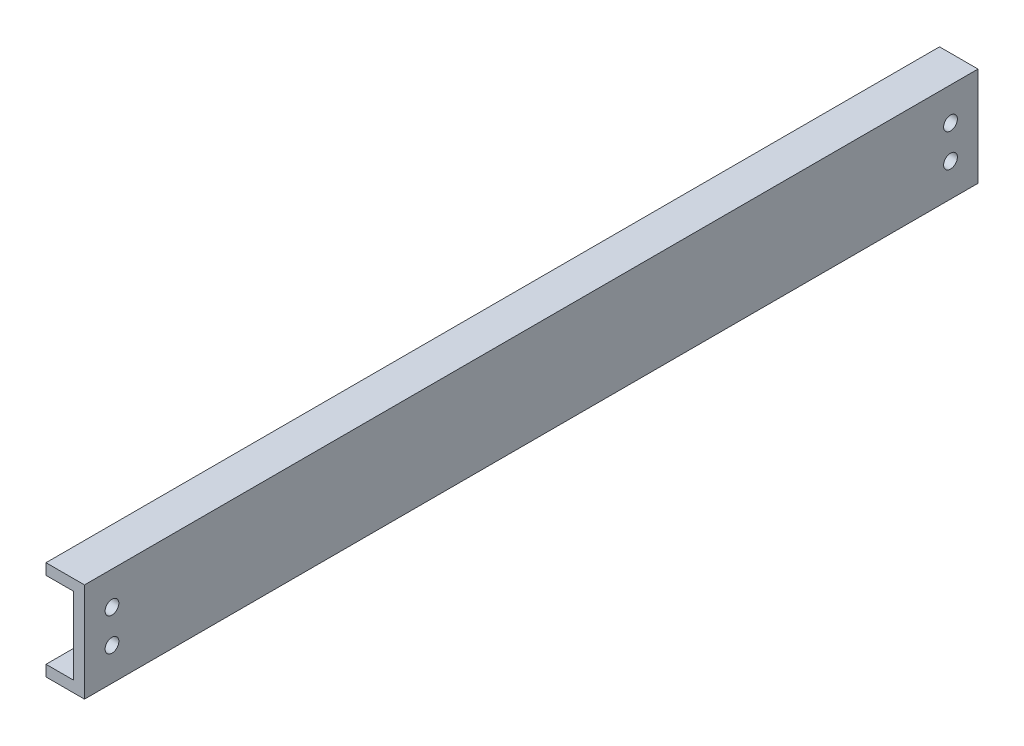
ISO-10303-21;
HEADER;
FILE_DESCRIPTION(('STEP AP214'),'2;1');
FILE_NAME('part.step','',(''),(''),'','','');
FILE_SCHEMA(('AUTOMOTIVE_DESIGN { 1 0 10303 214 1 1 1 1 }'));
ENDSEC;
DATA;
#1=APPLICATION_CONTEXT('core data for automotive mechanical design processes');
#2=APPLICATION_PROTOCOL_DEFINITION('international standard','automotive_design',2000,#1);
#3=PRODUCT_CONTEXT('',#1,'mechanical');
#4=PRODUCT('Part','Part','',(#3));
#5=PRODUCT_RELATED_PRODUCT_CATEGORY('part','',(#4));
#6=PRODUCT_DEFINITION_FORMATION('','',#4);
#7=PRODUCT_DEFINITION_CONTEXT('part definition',#1,'design');
#8=PRODUCT_DEFINITION('design','',#6,#7);
#9=PRODUCT_DEFINITION_SHAPE('','',#8);
#10=(LENGTH_UNIT() NAMED_UNIT(*) SI_UNIT(.MILLI.,.METRE.));
#11=(NAMED_UNIT(*) PLANE_ANGLE_UNIT() SI_UNIT($,.RADIAN.));
#12=(NAMED_UNIT(*) SI_UNIT($,.STERADIAN.) SOLID_ANGLE_UNIT());
#13=UNCERTAINTY_MEASURE_WITH_UNIT(LENGTH_MEASURE(1.E-05),#10,'distance_accuracy_value','');
#14=(GEOMETRIC_REPRESENTATION_CONTEXT(3) GLOBAL_UNCERTAINTY_ASSIGNED_CONTEXT((#13)) GLOBAL_UNIT_ASSIGNED_CONTEXT((#10,
#11,#12)) REPRESENTATION_CONTEXT('',''));
#15=CARTESIAN_POINT('',(0.,0.,0.));
#16=DIRECTION('',(0.,0.,1.));
#17=DIRECTION('',(1.,0.,0.));
#18=AXIS2_PLACEMENT_3D('',#15,#16,#17);
#19=CARTESIAN_POINT('',(-7.,9.88828278471343,-162.5));
#20=DIRECTION('',(-1.,0.,0.));
#21=DIRECTION('',(0.,0.,1.));
#22=AXIS2_PLACEMENT_3D('',#19,#20,#21);
#23=PLANE('',#22);
#24=DIRECTION('',(0.,-1.,0.));
#25=VECTOR('',#24,1.);
#26=CARTESIAN_POINT('',(-7.,9.88828278471343,0.));
#27=LINE('',#26,#25);
#28=CARTESIAN_POINT('',(-7.,9.88828278471343,0.));
#29=VERTEX_POINT('',#28);
#30=CARTESIAN_POINT('',(-7.,7.88828278471343,0.));
#31=VERTEX_POINT('',#30);
#32=EDGE_CURVE('E135',#29,#31,#27,.T.);
#33=ORIENTED_EDGE('',*,*,#32,.F.);
#34=DIRECTION('',(0.,0.,1.));
#35=VECTOR('',#34,1.);
#36=CARTESIAN_POINT('',(-7.,9.88828278471343,-162.5));
#37=LINE('',#36,#35);
#38=CARTESIAN_POINT('',(-7.,9.88828278471343,-162.5));
#39=VERTEX_POINT('',#38);
#40=EDGE_CURVE('E11',#39,#29,#37,.T.);
#41=ORIENTED_EDGE('',*,*,#40,.F.);
#42=DIRECTION('',(0.,-1.,0.));
#43=VECTOR('',#42,1.);
#44=CARTESIAN_POINT('',(-7.,9.88828278471343,-162.5));
#45=LINE('',#44,#43);
#46=CARTESIAN_POINT('',(-7.,7.88828278471343,-162.5));
#47=VERTEX_POINT('',#46);
#48=EDGE_CURVE('E155',#39,#47,#45,.T.);
#49=ORIENTED_EDGE('',*,*,#48,.T.);
#50=DIRECTION('',(0.,0.,1.));
#51=VECTOR('',#50,1.);
#52=CARTESIAN_POINT('',(-7.,7.88828278471343,-162.5));
#53=LINE('',#52,#51);
#54=EDGE_CURVE('E93',#47,#31,#53,.T.);
#55=ORIENTED_EDGE('',*,*,#54,.T.);
#56=EDGE_LOOP('',(#33,#41,#49,#55));
#57=FACE_BOUND('',#56,.T.);
#58=ADVANCED_FACE('F37',(#57),#23,.T.);
#59=CARTESIAN_POINT('',(-7.,9.88828278471343,-162.5));
#60=DIRECTION('',(0.,1.,0.));
#61=DIRECTION('',(-1.,0.,0.));
#62=AXIS2_PLACEMENT_3D('',#59,#60,#61);
#63=PLANE('',#62);
#64=DIRECTION('',(-1.,0.,0.));
#65=VECTOR('',#64,1.);
#66=CARTESIAN_POINT('',(-7.,9.88828278471343,0.));
#67=LINE('',#66,#65);
#68=CARTESIAN_POINT('',(0.,9.88828278471343,0.));
#69=VERTEX_POINT('',#68);
#70=EDGE_CURVE('E153',#69,#29,#67,.T.);
#71=ORIENTED_EDGE('',*,*,#70,.F.);
#72=DIRECTION('',(0.,0.,1.));
#73=VECTOR('',#72,1.);
#74=CARTESIAN_POINT('',(0.,9.88828278471343,-162.5));
#75=LINE('',#74,#73);
#76=CARTESIAN_POINT('',(0.,9.88828278471343,-162.5));
#77=VERTEX_POINT('',#76);
#78=EDGE_CURVE('E46',#77,#69,#75,.T.);
#79=ORIENTED_EDGE('',*,*,#78,.F.);
#80=DIRECTION('',(-1.,0.,0.));
#81=VECTOR('',#80,1.);
#82=CARTESIAN_POINT('',(-7.,9.88828278471343,-162.5));
#83=LINE('',#82,#81);
#84=EDGE_CURVE('E125',#77,#39,#83,.T.);
#85=ORIENTED_EDGE('',*,*,#84,.T.);
#86=ORIENTED_EDGE('',*,*,#40,.T.);
#87=EDGE_LOOP('',(#71,#79,#85,#86));
#88=FACE_BOUND('',#87,.T.);
#89=ADVANCED_FACE('F211',(#88),#63,.T.);
#90=CARTESIAN_POINT('',(0.,9.88828278471343,-162.5));
#91=DIRECTION('',(1.,0.,0.));
#92=DIRECTION('',(0.,1.,0.));
#93=AXIS2_PLACEMENT_3D('',#90,#91,#92);
#94=PLANE('',#93);
#95=CARTESIAN_POINT('',(0.,3.88828278471345,-157.5));
#96=DIRECTION('',(1.,0.,0.));
#97=DIRECTION('',(0.,-1.,0.));
#98=AXIS2_PLACEMENT_3D('',#95,#96,#97);
#99=CIRCLE('',#98,1.25000000000004);
#100=CARTESIAN_POINT('',(0.,2.63828278471341,-157.5));
#101=VERTEX_POINT('',#100);
#102=EDGE_CURVE('E261',#101,#101,#99,.T.);
#103=ORIENTED_EDGE('',*,*,#102,.F.);
#104=EDGE_LOOP('',(#103));
#105=FACE_BOUND('',#104,.T.);
#106=CARTESIAN_POINT('',(0.,-2.11171721528655,-157.5));
#107=DIRECTION('',(1.,0.,0.));
#108=DIRECTION('',(0.,1.,0.));
#109=AXIS2_PLACEMENT_3D('',#106,#107,#108);
#110=CIRCLE('',#109,1.25000000000004);
#111=CARTESIAN_POINT('',(0.,-0.861717215286511,-157.5));
#112=VERTEX_POINT('',#111);
#113=EDGE_CURVE('E257',#112,#112,#110,.T.);
#114=ORIENTED_EDGE('',*,*,#113,.F.);
#115=EDGE_LOOP('',(#114));
#116=FACE_BOUND('',#115,.T.);
#117=CARTESIAN_POINT('',(0.,-2.11171721528657,-5.));
#118=DIRECTION('',(1.,0.,0.));
#119=DIRECTION('',(0.,-1.,0.));
#120=AXIS2_PLACEMENT_3D('',#117,#118,#119);
#121=CIRCLE('',#120,1.25);
#122=CARTESIAN_POINT('',(0.,-3.36171721528657,-5.));
#123=VERTEX_POINT('',#122);
#124=EDGE_CURVE('E255',#123,#123,#121,.T.);
#125=ORIENTED_EDGE('',*,*,#124,.F.);
#126=EDGE_LOOP('',(#125));
#127=FACE_BOUND('',#126,.T.);
#128=CARTESIAN_POINT('',(0.,3.88828278471343,-5.));
#129=DIRECTION('',(1.,0.,0.));
#130=DIRECTION('',(0.,1.,0.));
#131=AXIS2_PLACEMENT_3D('',#128,#129,#130);
#132=CIRCLE('',#131,1.25);
#133=CARTESIAN_POINT('',(0.,5.13828278471343,-5.));
#134=VERTEX_POINT('',#133);
#135=EDGE_CURVE('E170',#134,#134,#132,.T.);
#136=ORIENTED_EDGE('',*,*,#135,.F.);
#137=EDGE_LOOP('',(#136));
#138=FACE_BOUND('',#137,.T.);
#139=DIRECTION('',(0.,1.,0.));
#140=VECTOR('',#139,1.);
#141=CARTESIAN_POINT('',(0.,9.88828278471343,0.));
#142=LINE('',#141,#140);
#143=CARTESIAN_POINT('',(0.,-8.11171721528657,0.));
#144=VERTEX_POINT('',#143);
#145=EDGE_CURVE('E112',#144,#69,#142,.T.);
#146=ORIENTED_EDGE('',*,*,#145,.F.);
#147=DIRECTION('',(0.,0.,1.));
#148=VECTOR('',#147,1.);
#149=CARTESIAN_POINT('',(0.,-8.11171721528657,-162.5));
#150=LINE('',#149,#148);
#151=CARTESIAN_POINT('',(0.,-8.11171721528657,-162.5));
#152=VERTEX_POINT('',#151);
#153=EDGE_CURVE('E107',#152,#144,#150,.T.);
#154=ORIENTED_EDGE('',*,*,#153,.F.);
#155=DIRECTION('',(0.,1.,0.));
#156=VECTOR('',#155,1.);
#157=CARTESIAN_POINT('',(0.,9.88828278471343,-162.5));
#158=LINE('',#157,#156);
#159=EDGE_CURVE('E110',#152,#77,#158,.T.);
#160=ORIENTED_EDGE('',*,*,#159,.T.);
#161=ORIENTED_EDGE('',*,*,#78,.T.);
#162=EDGE_LOOP('',(#146,#154,#160,#161));
#163=FACE_BOUND('',#162,.T.);
#164=ADVANCED_FACE('F109',(#105,#116,#127,#138,#163),#94,.T.);
#165=CARTESIAN_POINT('',(0.,-8.11171721528657,-162.5));
#166=DIRECTION('',(0.,-1.,0.));
#167=DIRECTION('',(1.,0.,0.));
#168=AXIS2_PLACEMENT_3D('',#165,#166,#167);
#169=PLANE('',#168);
#170=DIRECTION('',(1.,0.,0.));
#171=VECTOR('',#170,1.);
#172=CARTESIAN_POINT('',(0.,-8.11171721528657,0.));
#173=LINE('',#172,#171);
#174=CARTESIAN_POINT('',(-7.,-8.11171721528657,0.));
#175=VERTEX_POINT('',#174);
#176=EDGE_CURVE('E150',#175,#144,#173,.T.);
#177=ORIENTED_EDGE('',*,*,#176,.F.);
#178=DIRECTION('',(0.,0.,1.));
#179=VECTOR('',#178,1.);
#180=CARTESIAN_POINT('',(-7.,-8.11171721528657,-162.5));
#181=LINE('',#180,#179);
#182=CARTESIAN_POINT('',(-7.,-8.11171721528657,-162.5));
#183=VERTEX_POINT('',#182);
#184=EDGE_CURVE('E117',#183,#175,#181,.T.);
#185=ORIENTED_EDGE('',*,*,#184,.F.);
#186=DIRECTION('',(1.,0.,0.));
#187=VECTOR('',#186,1.);
#188=CARTESIAN_POINT('',(0.,-8.11171721528657,-162.5));
#189=LINE('',#188,#187);
#190=EDGE_CURVE('E123',#183,#152,#189,.T.);
#191=ORIENTED_EDGE('',*,*,#190,.T.);
#192=ORIENTED_EDGE('',*,*,#153,.T.);
#193=EDGE_LOOP('',(#177,#185,#191,#192));
#194=FACE_BOUND('',#193,.T.);
#195=ADVANCED_FACE('F127',(#194),#169,.T.);
#196=CARTESIAN_POINT('',(-7.,-8.11171721528657,-162.5));
#197=DIRECTION('',(-1.,0.,0.));
#198=DIRECTION('',(0.,0.,1.));
#199=AXIS2_PLACEMENT_3D('',#196,#197,#198);
#200=PLANE('',#199);
#201=DIRECTION('',(0.,-1.,0.));
#202=VECTOR('',#201,1.);
#203=CARTESIAN_POINT('',(-7.,-8.11171721528657,0.));
#204=LINE('',#203,#202);
#205=CARTESIAN_POINT('',(-7.,-6.11171721528657,0.));
#206=VERTEX_POINT('',#205);
#207=EDGE_CURVE('E147',#206,#175,#204,.T.);
#208=ORIENTED_EDGE('',*,*,#207,.F.);
#209=DIRECTION('',(0.,0.,1.));
#210=VECTOR('',#209,1.);
#211=CARTESIAN_POINT('',(-7.,-6.11171721528657,-162.5));
#212=LINE('',#211,#210);
#213=CARTESIAN_POINT('',(-7.,-6.11171721528657,-162.5));
#214=VERTEX_POINT('',#213);
#215=EDGE_CURVE('E159',#214,#206,#212,.T.);
#216=ORIENTED_EDGE('',*,*,#215,.F.);
#217=DIRECTION('',(0.,-1.,0.));
#218=VECTOR('',#217,1.);
#219=CARTESIAN_POINT('',(-7.,-8.11171721528657,-162.5));
#220=LINE('',#219,#218);
#221=EDGE_CURVE('E128',#214,#183,#220,.T.);
#222=ORIENTED_EDGE('',*,*,#221,.T.);
#223=ORIENTED_EDGE('',*,*,#184,.T.);
#224=EDGE_LOOP('',(#208,#216,#222,#223));
#225=FACE_BOUND('',#224,.T.);
#226=ADVANCED_FACE('F210',(#225),#200,.T.);
#227=CARTESIAN_POINT('',(-2.,-6.11171721528657,-162.5));
#228=DIRECTION('',(0.,1.,0.));
#229=DIRECTION('',(0.,0.,1.));
#230=AXIS2_PLACEMENT_3D('',#227,#228,#229);
#231=PLANE('',#230);
#232=DIRECTION('',(-1.,0.,0.));
#233=VECTOR('',#232,1.);
#234=CARTESIAN_POINT('',(-2.,-6.11171721528657,0.));
#235=LINE('',#234,#233);
#236=CARTESIAN_POINT('',(-2.,-6.11171721528657,0.));
#237=VERTEX_POINT('',#236);
#238=EDGE_CURVE('E144',#237,#206,#235,.T.);
#239=ORIENTED_EDGE('',*,*,#238,.F.);
#240=DIRECTION('',(0.,0.,1.));
#241=VECTOR('',#240,1.);
#242=CARTESIAN_POINT('',(-2.,-6.11171721528657,-162.5));
#243=LINE('',#242,#241);
#244=CARTESIAN_POINT('',(-2.,-6.11171721528657,-162.5));
#245=VERTEX_POINT('',#244);
#246=EDGE_CURVE('E161',#245,#237,#243,.T.);
#247=ORIENTED_EDGE('',*,*,#246,.F.);
#248=DIRECTION('',(-1.,0.,0.));
#249=VECTOR('',#248,1.);
#250=CARTESIAN_POINT('',(-2.,-6.11171721528657,-162.5));
#251=LINE('',#250,#249);
#252=EDGE_CURVE('E130',#245,#214,#251,.T.);
#253=ORIENTED_EDGE('',*,*,#252,.T.);
#254=ORIENTED_EDGE('',*,*,#215,.T.);
#255=EDGE_LOOP('',(#239,#247,#253,#254));
#256=FACE_BOUND('',#255,.T.);
#257=ADVANCED_FACE('F186',(#256),#231,.T.);
#258=CARTESIAN_POINT('',(-2.,7.88828278471343,-162.5));
#259=DIRECTION('',(-1.,0.,0.));
#260=DIRECTION('',(0.,-1.,0.));
#261=AXIS2_PLACEMENT_3D('',#258,#259,#260);
#262=PLANE('',#261);
#263=CARTESIAN_POINT('',(-2.,3.88828278471345,-157.5));
#264=DIRECTION('',(-1.,0.,0.));
#265=DIRECTION('',(0.,-1.,0.));
#266=AXIS2_PLACEMENT_3D('',#263,#264,#265);
#267=CIRCLE('',#266,1.25000000000004);
#268=CARTESIAN_POINT('',(-2.,2.63828278471341,-157.5));
#269=VERTEX_POINT('',#268);
#270=EDGE_CURVE('E40',#269,#269,#267,.T.);
#271=ORIENTED_EDGE('',*,*,#270,.F.);
#272=EDGE_LOOP('',(#271));
#273=FACE_BOUND('',#272,.T.);
#274=CARTESIAN_POINT('',(-2.,-2.11171721528655,-157.5));
#275=DIRECTION('',(-1.,0.,0.));
#276=DIRECTION('',(0.,-1.,0.));
#277=AXIS2_PLACEMENT_3D('',#274,#275,#276);
#278=CIRCLE('',#277,1.25000000000004);
#279=CARTESIAN_POINT('',(-2.,-3.36171721528659,-157.5));
#280=VERTEX_POINT('',#279);
#281=EDGE_CURVE('E172',#280,#280,#278,.T.);
#282=ORIENTED_EDGE('',*,*,#281,.F.);
#283=EDGE_LOOP('',(#282));
#284=FACE_BOUND('',#283,.T.);
#285=CARTESIAN_POINT('',(-2.,-2.11171721528657,-5.));
#286=DIRECTION('',(-1.,0.,0.));
#287=DIRECTION('',(0.,-1.,0.));
#288=AXIS2_PLACEMENT_3D('',#285,#286,#287);
#289=CIRCLE('',#288,1.25);
#290=CARTESIAN_POINT('',(-2.,-3.36171721528657,-5.));
#291=VERTEX_POINT('',#290);
#292=EDGE_CURVE('E169',#291,#291,#289,.T.);
#293=ORIENTED_EDGE('',*,*,#292,.F.);
#294=EDGE_LOOP('',(#293));
#295=FACE_BOUND('',#294,.T.);
#296=CARTESIAN_POINT('',(-2.,3.88828278471343,-5.));
#297=DIRECTION('',(-1.,0.,0.));
#298=DIRECTION('',(0.,-1.,0.));
#299=AXIS2_PLACEMENT_3D('',#296,#297,#298);
#300=CIRCLE('',#299,1.25);
#301=CARTESIAN_POINT('',(-2.,2.63828278471343,-5.));
#302=VERTEX_POINT('',#301);
#303=EDGE_CURVE('E166',#302,#302,#300,.T.);
#304=ORIENTED_EDGE('',*,*,#303,.F.);
#305=EDGE_LOOP('',(#304));
#306=FACE_BOUND('',#305,.T.);
#307=DIRECTION('',(0.,-1.,0.));
#308=VECTOR('',#307,1.);
#309=CARTESIAN_POINT('',(-2.,7.88828278471343,0.));
#310=LINE('',#309,#308);
#311=CARTESIAN_POINT('',(-2.,7.88828278471343,0.));
#312=VERTEX_POINT('',#311);
#313=EDGE_CURVE('E141',#312,#237,#310,.T.);
#314=ORIENTED_EDGE('',*,*,#313,.F.);
#315=DIRECTION('',(0.,0.,1.));
#316=VECTOR('',#315,1.);
#317=CARTESIAN_POINT('',(-2.,7.88828278471343,-162.5));
#318=LINE('',#317,#316);
#319=CARTESIAN_POINT('',(-2.,7.88828278471343,-162.5));
#320=VERTEX_POINT('',#319);
#321=EDGE_CURVE('E163',#320,#312,#318,.T.);
#322=ORIENTED_EDGE('',*,*,#321,.F.);
#323=DIRECTION('',(0.,-1.,0.));
#324=VECTOR('',#323,1.);
#325=CARTESIAN_POINT('',(-2.,7.88828278471343,-162.5));
#326=LINE('',#325,#324);
#327=EDGE_CURVE('E200',#320,#245,#326,.T.);
#328=ORIENTED_EDGE('',*,*,#327,.T.);
#329=ORIENTED_EDGE('',*,*,#246,.T.);
#330=EDGE_LOOP('',(#314,#322,#328,#329));
#331=FACE_BOUND('',#330,.T.);
#332=ADVANCED_FACE('F182',(#273,#284,#295,#306,#331),#262,.T.);
#333=CARTESIAN_POINT('',(-7.,7.88828278471343,-162.5));
#334=DIRECTION('',(0.,-1.,0.));
#335=DIRECTION('',(0.,0.,-1.));
#336=AXIS2_PLACEMENT_3D('',#333,#334,#335);
#337=PLANE('',#336);
#338=DIRECTION('',(1.,0.,0.));
#339=VECTOR('',#338,1.);
#340=CARTESIAN_POINT('',(-7.,7.88828278471343,0.));
#341=LINE('',#340,#339);
#342=EDGE_CURVE('E138',#31,#312,#341,.T.);
#343=ORIENTED_EDGE('',*,*,#342,.F.);
#344=ORIENTED_EDGE('',*,*,#54,.F.);
#345=DIRECTION('',(1.,0.,0.));
#346=VECTOR('',#345,1.);
#347=CARTESIAN_POINT('',(-7.,7.88828278471343,-162.5));
#348=LINE('',#347,#346);
#349=EDGE_CURVE('E199',#47,#320,#348,.T.);
#350=ORIENTED_EDGE('',*,*,#349,.T.);
#351=ORIENTED_EDGE('',*,*,#321,.T.);
#352=EDGE_LOOP('',(#343,#344,#350,#351));
#353=FACE_BOUND('',#352,.T.);
#354=ADVANCED_FACE('F185',(#353),#337,.T.);
#355=CARTESIAN_POINT('',(0.,0.,-162.5));
#356=DIRECTION('',(0.,0.,1.));
#357=DIRECTION('',(1.,0.,0.));
#358=AXIS2_PLACEMENT_3D('',#355,#356,#357);
#359=PLANE('',#358);
#360=ORIENTED_EDGE('',*,*,#48,.F.);
#361=ORIENTED_EDGE('',*,*,#84,.F.);
#362=ORIENTED_EDGE('',*,*,#159,.F.);
#363=ORIENTED_EDGE('',*,*,#190,.F.);
#364=ORIENTED_EDGE('',*,*,#221,.F.);
#365=ORIENTED_EDGE('',*,*,#252,.F.);
#366=ORIENTED_EDGE('',*,*,#327,.F.);
#367=ORIENTED_EDGE('',*,*,#349,.F.);
#368=EDGE_LOOP('',(#360,#361,#362,#363,#364,#365,#366,#367));
#369=FACE_BOUND('',#368,.T.);
#370=ADVANCED_FACE('F121',(#369),#359,.F.);
#371=CARTESIAN_POINT('',(0.,0.,0.));
#372=DIRECTION('',(0.,0.,1.));
#373=DIRECTION('',(1.,0.,0.));
#374=AXIS2_PLACEMENT_3D('',#371,#372,#373);
#375=PLANE('',#374);
#376=ORIENTED_EDGE('',*,*,#32,.T.);
#377=ORIENTED_EDGE('',*,*,#342,.T.);
#378=ORIENTED_EDGE('',*,*,#313,.T.);
#379=ORIENTED_EDGE('',*,*,#238,.T.);
#380=ORIENTED_EDGE('',*,*,#207,.T.);
#381=ORIENTED_EDGE('',*,*,#176,.T.);
#382=ORIENTED_EDGE('',*,*,#145,.T.);
#383=ORIENTED_EDGE('',*,*,#70,.T.);
#384=EDGE_LOOP('',(#376,#377,#378,#379,#380,#381,#382,#383));
#385=FACE_BOUND('',#384,.T.);
#386=ADVANCED_FACE('F198',(#385),#375,.T.);
#387=CARTESIAN_POINT('',(-7.,3.88828278471343,-5.));
#388=DIRECTION('',(1.,0.,0.));
#389=DIRECTION('',(0.,1.,0.));
#390=AXIS2_PLACEMENT_3D('',#387,#388,#389);
#391=CYLINDRICAL_SURFACE('',#390,1.25);
#392=ORIENTED_EDGE('',*,*,#303,.T.);
#393=EDGE_LOOP('',(#392));
#394=FACE_BOUND('',#393,.T.);
#395=ORIENTED_EDGE('',*,*,#135,.T.);
#396=EDGE_LOOP('',(#395));
#397=FACE_BOUND('',#396,.T.);
#398=ADVANCED_FACE('F237',(#394,#397),#391,.F.);
#399=CARTESIAN_POINT('',(-7.,-2.11171721528657,-5.));
#400=DIRECTION('',(1.,0.,0.));
#401=DIRECTION('',(0.,1.,0.));
#402=AXIS2_PLACEMENT_3D('',#399,#400,#401);
#403=CYLINDRICAL_SURFACE('',#402,1.25);
#404=ORIENTED_EDGE('',*,*,#292,.T.);
#405=EDGE_LOOP('',(#404));
#406=FACE_BOUND('',#405,.T.);
#407=ORIENTED_EDGE('',*,*,#124,.T.);
#408=EDGE_LOOP('',(#407));
#409=FACE_BOUND('',#408,.T.);
#410=ADVANCED_FACE('F241',(#406,#409),#403,.F.);
#411=CARTESIAN_POINT('',(-7.,-2.11171721528655,-157.5));
#412=DIRECTION('',(1.,0.,0.));
#413=DIRECTION('',(0.,1.,0.));
#414=AXIS2_PLACEMENT_3D('',#411,#412,#413);
#415=CYLINDRICAL_SURFACE('',#414,1.25000000000004);
#416=ORIENTED_EDGE('',*,*,#281,.T.);
#417=EDGE_LOOP('',(#416));
#418=FACE_BOUND('',#417,.T.);
#419=ORIENTED_EDGE('',*,*,#113,.T.);
#420=EDGE_LOOP('',(#419));
#421=FACE_BOUND('',#420,.T.);
#422=ADVANCED_FACE('F245',(#418,#421),#415,.F.);
#423=CARTESIAN_POINT('',(-7.,3.88828278471345,-157.5));
#424=DIRECTION('',(1.,0.,0.));
#425=DIRECTION('',(0.,1.,0.));
#426=AXIS2_PLACEMENT_3D('',#423,#424,#425);
#427=CYLINDRICAL_SURFACE('',#426,1.25000000000004);
#428=ORIENTED_EDGE('',*,*,#270,.T.);
#429=EDGE_LOOP('',(#428));
#430=FACE_BOUND('',#429,.T.);
#431=ORIENTED_EDGE('',*,*,#102,.T.);
#432=EDGE_LOOP('',(#431));
#433=FACE_BOUND('',#432,.T.);
#434=ADVANCED_FACE('F179',(#430,#433),#427,.F.);
#435=CLOSED_SHELL('',(#58,#89,#164,#195,#226,#257,#332,#354,#370,#386,#398,#410,#422,#434));
#436=MANIFOLD_SOLID_BREP('B2',#435);
#437=ADVANCED_BREP_SHAPE_REPRESENTATION('',(#18,#436),#14);
#438=SHAPE_DEFINITION_REPRESENTATION(#9,#437);
ENDSEC;
END-ISO-10303-21;
